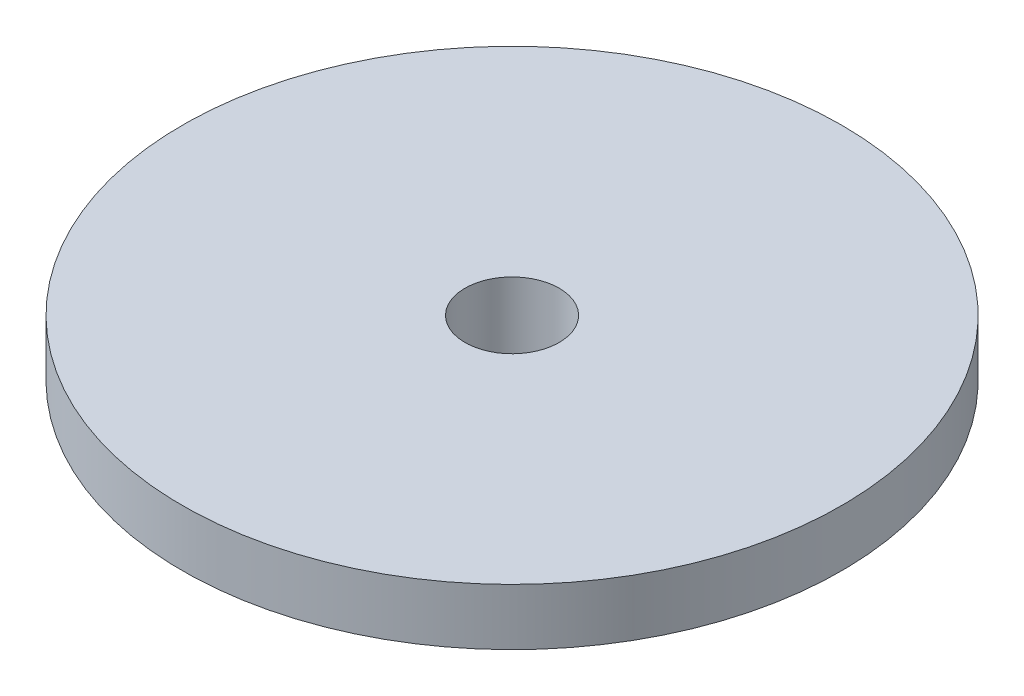
ISO-10303-21;
HEADER;
FILE_DESCRIPTION(('STEP AP214'),'2;1');
FILE_NAME('part.step','',(''),(''),'','','');
FILE_SCHEMA(('AUTOMOTIVE_DESIGN { 1 0 10303 214 1 1 1 1 }'));
ENDSEC;
DATA;
#1=APPLICATION_CONTEXT('core data for automotive mechanical design processes');
#2=APPLICATION_PROTOCOL_DEFINITION('international standard','automotive_design',2000,#1);
#3=PRODUCT_CONTEXT('',#1,'mechanical');
#4=PRODUCT('Part','Part','',(#3));
#5=PRODUCT_RELATED_PRODUCT_CATEGORY('part','',(#4));
#6=PRODUCT_DEFINITION_FORMATION('','',#4);
#7=PRODUCT_DEFINITION_CONTEXT('part definition',#1,'design');
#8=PRODUCT_DEFINITION('design','',#6,#7);
#9=PRODUCT_DEFINITION_SHAPE('','',#8);
#10=(LENGTH_UNIT() NAMED_UNIT(*) SI_UNIT(.MILLI.,.METRE.));
#11=(NAMED_UNIT(*) PLANE_ANGLE_UNIT() SI_UNIT($,.RADIAN.));
#12=(NAMED_UNIT(*) SI_UNIT($,.STERADIAN.) SOLID_ANGLE_UNIT());
#13=UNCERTAINTY_MEASURE_WITH_UNIT(LENGTH_MEASURE(1.E-05),#10,'distance_accuracy_value','');
#14=(GEOMETRIC_REPRESENTATION_CONTEXT(3) GLOBAL_UNCERTAINTY_ASSIGNED_CONTEXT((#13)) GLOBAL_UNIT_ASSIGNED_CONTEXT((#10,
#11,#12)) REPRESENTATION_CONTEXT('',''));
#15=CARTESIAN_POINT('',(0.,0.,0.));
#16=DIRECTION('',(0.,0.,1.));
#17=DIRECTION('',(1.,0.,0.));
#18=AXIS2_PLACEMENT_3D('',#15,#16,#17);
#19=CARTESIAN_POINT('',(7.,0.,0.));
#20=DIRECTION('',(0.,-1.,0.));
#21=DIRECTION('',(0.,0.,-1.));
#22=AXIS2_PLACEMENT_3D('',#19,#20,#21);
#23=PLANE('',#22);
#24=CARTESIAN_POINT('',(0.,0.,0.));
#25=DIRECTION('',(0.,-1.,0.));
#26=DIRECTION('',(0.,0.,-1.));
#27=AXIS2_PLACEMENT_3D('',#24,#25,#26);
#28=CIRCLE('',#27,2.5);
#29=CARTESIAN_POINT('',(0.,0.,-2.5));
#30=VERTEX_POINT('',#29);
#31=EDGE_CURVE('E56',#30,#30,#28,.T.);
#32=ORIENTED_EDGE('',*,*,#31,.F.);
#33=EDGE_LOOP('',(#32));
#34=FACE_BOUND('',#33,.T.);
#35=CARTESIAN_POINT('',(0.,0.,0.));
#36=DIRECTION('',(0.,-1.,0.));
#37=DIRECTION('',(0.,0.,-1.));
#38=AXIS2_PLACEMENT_3D('',#35,#36,#37);
#39=CIRCLE('',#38,7.);
#40=CARTESIAN_POINT('',(0.,0.,-7.));
#41=VERTEX_POINT('',#40);
#42=EDGE_CURVE('E49',#41,#41,#39,.T.);
#43=ORIENTED_EDGE('',*,*,#42,.T.);
#44=EDGE_LOOP('',(#43));
#45=FACE_BOUND('',#44,.T.);
#46=ADVANCED_FACE('F39',(#34,#45),#23,.T.);
#47=CARTESIAN_POINT('',(0.,10.,0.));
#48=DIRECTION('',(0.,1.,0.));
#49=DIRECTION('',(0.,0.,1.));
#50=AXIS2_PLACEMENT_3D('',#47,#48,#49);
#51=PLANE('',#50);
#52=CARTESIAN_POINT('',(0.,10.,0.));
#53=DIRECTION('',(0.,-1.,0.));
#54=DIRECTION('',(0.,0.,-1.));
#55=AXIS2_PLACEMENT_3D('',#52,#53,#54);
#56=CIRCLE('',#55,2.5);
#57=CARTESIAN_POINT('',(0.,10.,-2.5));
#58=VERTEX_POINT('',#57);
#59=EDGE_CURVE('E53',#58,#58,#56,.T.);
#60=ORIENTED_EDGE('',*,*,#59,.T.);
#61=EDGE_LOOP('',(#60));
#62=FACE_BOUND('',#61,.T.);
#63=CARTESIAN_POINT('',(0.,10.,0.));
#64=DIRECTION('',(0.,-1.,0.));
#65=DIRECTION('',(0.,0.,-1.));
#66=AXIS2_PLACEMENT_3D('',#63,#64,#65);
#67=CIRCLE('',#66,17.5);
#68=CARTESIAN_POINT('',(0.,10.,-17.5));
#69=VERTEX_POINT('',#68);
#70=EDGE_CURVE('E10',#69,#69,#67,.T.);
#71=ORIENTED_EDGE('',*,*,#70,.F.);
#72=EDGE_LOOP('',(#71));
#73=FACE_BOUND('',#72,.T.);
#74=ADVANCED_FACE('F62',(#62,#73),#51,.T.);
#75=CARTESIAN_POINT('',(0.,0.,0.));
#76=DIRECTION('',(0.,-1.,0.));
#77=DIRECTION('',(0.,0.,-1.));
#78=AXIS2_PLACEMENT_3D('',#75,#76,#77);
#79=CYLINDRICAL_SURFACE('',#78,17.5);
#80=ORIENTED_EDGE('',*,*,#70,.T.);
#81=EDGE_LOOP('',(#80));
#82=FACE_BOUND('',#81,.T.);
#83=CARTESIAN_POINT('',(0.,7.,0.));
#84=DIRECTION('',(0.,-1.,0.));
#85=DIRECTION('',(0.,0.,-1.));
#86=AXIS2_PLACEMENT_3D('',#83,#84,#85);
#87=CIRCLE('',#86,17.5);
#88=CARTESIAN_POINT('',(0.,7.,-17.5));
#89=VERTEX_POINT('',#88);
#90=EDGE_CURVE('E45',#89,#89,#87,.T.);
#91=ORIENTED_EDGE('',*,*,#90,.F.);
#92=EDGE_LOOP('',(#91));
#93=FACE_BOUND('',#92,.T.);
#94=ADVANCED_FACE('F77',(#82,#93),#79,.T.);
#95=CARTESIAN_POINT('',(0.,0.,0.));
#96=DIRECTION('',(0.,1.,0.));
#97=DIRECTION('',(0.,0.,1.));
#98=AXIS2_PLACEMENT_3D('',#95,#96,#97);
#99=CONICAL_SURFACE('',#98,7.,0.982793723247329);
#100=ORIENTED_EDGE('',*,*,#90,.T.);
#101=EDGE_LOOP('',(#100));
#102=FACE_BOUND('',#101,.T.);
#103=ORIENTED_EDGE('',*,*,#42,.F.);
#104=EDGE_LOOP('',(#103));
#105=FACE_BOUND('',#104,.T.);
#106=ADVANCED_FACE('F68',(#102,#105),#99,.T.);
#107=CARTESIAN_POINT('',(0.,10.,0.));
#108=DIRECTION('',(0.,-1.,0.));
#109=DIRECTION('',(0.,0.,-1.));
#110=AXIS2_PLACEMENT_3D('',#107,#108,#109);
#111=CYLINDRICAL_SURFACE('',#110,2.5);
#112=ORIENTED_EDGE('',*,*,#59,.F.);
#113=EDGE_LOOP('',(#112));
#114=FACE_BOUND('',#113,.T.);
#115=ORIENTED_EDGE('',*,*,#31,.T.);
#116=EDGE_LOOP('',(#115));
#117=FACE_BOUND('',#116,.T.);
#118=ADVANCED_FACE('F65',(#114,#117),#111,.F.);
#119=CLOSED_SHELL('',(#46,#74,#94,#106,#118));
#120=MANIFOLD_SOLID_BREP('B2',#119);
#121=ADVANCED_BREP_SHAPE_REPRESENTATION('',(#18,#120),#14);
#122=SHAPE_DEFINITION_REPRESENTATION(#9,#121);
ENDSEC;
END-ISO-10303-21;
